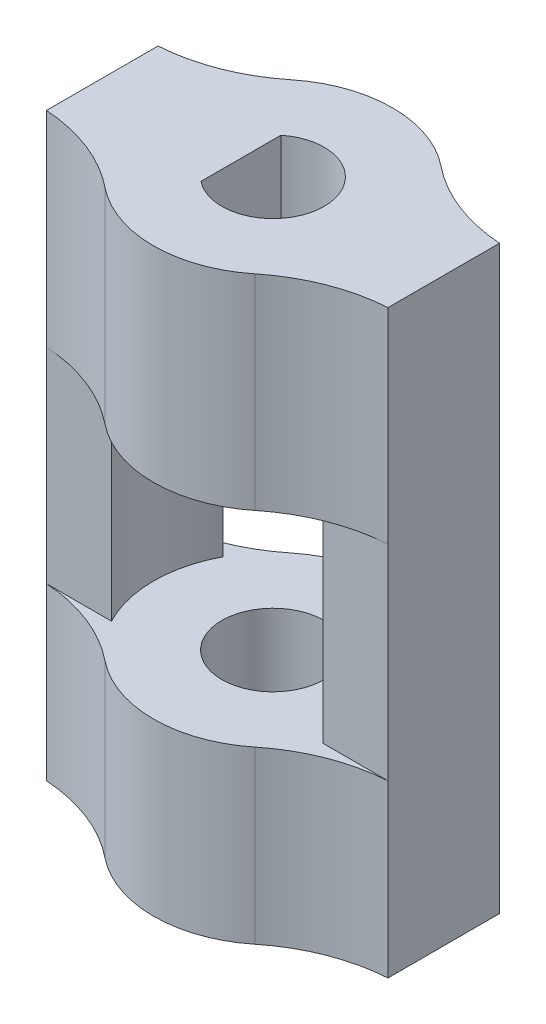
ISO-10303-21;
HEADER;
FILE_DESCRIPTION(('STEP AP214'),'2;1');
FILE_NAME('part.step','',(''),(''),'','','');
FILE_SCHEMA(('AUTOMOTIVE_DESIGN { 1 0 10303 214 1 1 1 1 }'));
ENDSEC;
DATA;
#1=APPLICATION_CONTEXT('core data for automotive mechanical design processes');
#2=APPLICATION_PROTOCOL_DEFINITION('international standard','automotive_design',2000,#1);
#3=PRODUCT_CONTEXT('',#1,'mechanical');
#4=PRODUCT('Part','Part','',(#3));
#5=PRODUCT_RELATED_PRODUCT_CATEGORY('part','',(#4));
#6=PRODUCT_DEFINITION_FORMATION('','',#4);
#7=PRODUCT_DEFINITION_CONTEXT('part definition',#1,'design');
#8=PRODUCT_DEFINITION('design','',#6,#7);
#9=PRODUCT_DEFINITION_SHAPE('','',#8);
#10=(LENGTH_UNIT() NAMED_UNIT(*) SI_UNIT(.MILLI.,.METRE.));
#11=(NAMED_UNIT(*) PLANE_ANGLE_UNIT() SI_UNIT($,.RADIAN.));
#12=(NAMED_UNIT(*) SI_UNIT($,.STERADIAN.) SOLID_ANGLE_UNIT());
#13=UNCERTAINTY_MEASURE_WITH_UNIT(LENGTH_MEASURE(1.E-05),#10,'distance_accuracy_value','');
#14=(GEOMETRIC_REPRESENTATION_CONTEXT(3) GLOBAL_UNCERTAINTY_ASSIGNED_CONTEXT((#13)) GLOBAL_UNIT_ASSIGNED_CONTEXT((#10,
#11,#12)) REPRESENTATION_CONTEXT('',''));
#15=CARTESIAN_POINT('',(0.,0.,0.));
#16=DIRECTION('',(0.,0.,1.));
#17=DIRECTION('',(1.,0.,0.));
#18=AXIS2_PLACEMENT_3D('',#15,#16,#17);
#19=CARTESIAN_POINT('',(0.,10.,0.));
#20=DIRECTION('',(0.,1.,0.));
#21=DIRECTION('',(0.,0.,1.));
#22=AXIS2_PLACEMENT_3D('',#19,#20,#21);
#23=PLANE('',#22);
#24=CARTESIAN_POINT('',(0.,10.,0.));
#25=DIRECTION('',(0.,1.,0.));
#26=DIRECTION('',(0.,0.,1.));
#27=AXIS2_PLACEMENT_3D('',#24,#25,#26);
#28=CIRCLE('',#27,7.);
#29=CARTESIAN_POINT('',(-6.19106594490267,10.,-3.26660411832632));
#30=VERTEX_POINT('',#29);
#31=CARTESIAN_POINT('',(-6.19106594490267,10.,3.26660411832632));
#32=VERTEX_POINT('',#31);
#33=EDGE_CURVE('E255',#30,#32,#28,.T.);
#34=ORIENTED_EDGE('',*,*,#33,.T.);
#35=DIRECTION('',(1.,0.,0.));
#36=VECTOR('',#35,1.);
#37=CARTESIAN_POINT('',(0.,10.,3.26660411832632));
#38=LINE('',#37,#36);
#39=CARTESIAN_POINT('',(-10.,10.,3.26660411832632));
#40=VERTEX_POINT('',#39);
#41=EDGE_CURVE('E343',#40,#32,#38,.T.);
#42=ORIENTED_EDGE('',*,*,#41,.F.);
#43=CARTESIAN_POINT('',(-10.6569167238109,10.,13.2450038105604));
#44=DIRECTION('',(0.,1.,0.));
#45=DIRECTION('',(0.,0.,1.));
#46=AXIS2_PLACEMENT_3D('',#43,#44,#45);
#47=CIRCLE('',#46,10.);
#48=CARTESIAN_POINT('',(-4.38814218039272,10.,5.45382509846605));
#49=VERTEX_POINT('',#48);
#50=EDGE_CURVE('E371',#40,#49,#47,.F.);
#51=ORIENTED_EDGE('',*,*,#50,.T.);
#52=CARTESIAN_POINT('',(0.,10.,0.));
#53=DIRECTION('',(0.,1.,0.));
#54=DIRECTION('',(0.,0.,1.));
#55=AXIS2_PLACEMENT_3D('',#52,#53,#54);
#56=CIRCLE('',#55,7.);
#57=CARTESIAN_POINT('',(4.38814218039272,10.,5.45382509846605));
#58=VERTEX_POINT('',#57);
#59=EDGE_CURVE('E282',#49,#58,#56,.T.);
#60=ORIENTED_EDGE('',*,*,#59,.T.);
#61=CARTESIAN_POINT('',(10.6569167238109,10.,13.2450038105604));
#62=DIRECTION('',(0.,1.,0.));
#63=DIRECTION('',(0.,0.,1.));
#64=AXIS2_PLACEMENT_3D('',#61,#62,#63);
#65=CIRCLE('',#64,10.);
#66=CARTESIAN_POINT('',(10.,10.,3.26660411832632));
#67=VERTEX_POINT('',#66);
#68=EDGE_CURVE('E363',#58,#67,#65,.F.);
#69=ORIENTED_EDGE('',*,*,#68,.T.);
#70=DIRECTION('',(1.,0.,0.));
#71=VECTOR('',#70,1.);
#72=CARTESIAN_POINT('',(0.,10.,3.26660411832632));
#73=LINE('',#72,#71);
#74=CARTESIAN_POINT('',(6.19106594490267,10.,3.26660411832632));
#75=VERTEX_POINT('',#74);
#76=EDGE_CURVE('E327',#75,#67,#73,.T.);
#77=ORIENTED_EDGE('',*,*,#76,.F.);
#78=CARTESIAN_POINT('',(0.,10.,0.));
#79=DIRECTION('',(0.,1.,0.));
#80=DIRECTION('',(0.,0.,1.));
#81=AXIS2_PLACEMENT_3D('',#78,#79,#80);
#82=CIRCLE('',#81,7.);
#83=CARTESIAN_POINT('',(6.19106594490267,10.,-3.26660411832632));
#84=VERTEX_POINT('',#83);
#85=EDGE_CURVE('E269',#75,#84,#82,.T.);
#86=ORIENTED_EDGE('',*,*,#85,.T.);
#87=DIRECTION('',(-1.,0.,0.));
#88=VECTOR('',#87,1.);
#89=CARTESIAN_POINT('',(0.,10.,-3.26660411832632));
#90=LINE('',#89,#88);
#91=CARTESIAN_POINT('',(10.,10.,-3.26660411832632));
#92=VERTEX_POINT('',#91);
#93=EDGE_CURVE('E359',#92,#84,#90,.T.);
#94=ORIENTED_EDGE('',*,*,#93,.F.);
#95=CARTESIAN_POINT('',(10.6569167238109,10.,-13.2450038105604));
#96=DIRECTION('',(0.,1.,0.));
#97=DIRECTION('',(0.,0.,1.));
#98=AXIS2_PLACEMENT_3D('',#95,#96,#97);
#99=CIRCLE('',#98,10.);
#100=CARTESIAN_POINT('',(4.38814218039272,10.,-5.45382509846605));
#101=VERTEX_POINT('',#100);
#102=EDGE_CURVE('E387',#92,#101,#99,.F.);
#103=ORIENTED_EDGE('',*,*,#102,.T.);
#104=CARTESIAN_POINT('',(0.,10.,0.));
#105=DIRECTION('',(0.,1.,0.));
#106=DIRECTION('',(0.,0.,1.));
#107=AXIS2_PLACEMENT_3D('',#104,#105,#106);
#108=CIRCLE('',#107,7.);
#109=CARTESIAN_POINT('',(-4.38814218039272,10.,-5.45382509846605));
#110=VERTEX_POINT('',#109);
#111=EDGE_CURVE('E285',#101,#110,#108,.T.);
#112=ORIENTED_EDGE('',*,*,#111,.T.);
#113=CARTESIAN_POINT('',(-10.6569167238109,10.,-13.2450038105604));
#114=DIRECTION('',(0.,1.,0.));
#115=DIRECTION('',(0.,0.,1.));
#116=AXIS2_PLACEMENT_3D('',#113,#114,#115);
#117=CIRCLE('',#116,10.);
#118=CARTESIAN_POINT('',(-10.,10.,-3.26660411832632));
#119=VERTEX_POINT('',#118);
#120=EDGE_CURVE('E383',#110,#119,#117,.F.);
#121=ORIENTED_EDGE('',*,*,#120,.T.);
#122=DIRECTION('',(-1.,0.,0.));
#123=VECTOR('',#122,1.);
#124=CARTESIAN_POINT('',(0.,10.,-3.26660411832632));
#125=LINE('',#124,#123);
#126=EDGE_CURVE('E90',#30,#119,#125,.T.);
#127=ORIENTED_EDGE('',*,*,#126,.F.);
#128=EDGE_LOOP('',(#34,#42,#51,#60,#69,#77,#86,#94,#103,#112,#121,#127));
#129=FACE_BOUND('',#128,.T.);
#130=CARTESIAN_POINT('',(0.,10.,0.));
#131=DIRECTION('',(0.,1.,0.));
#132=DIRECTION('',(0.,0.,1.));
#133=AXIS2_PLACEMENT_3D('',#130,#131,#132);
#134=CIRCLE('',#133,3.);
#135=CARTESIAN_POINT('',(0.,10.,3.));
#136=VERTEX_POINT('',#135);
#137=EDGE_CURVE('E289',#136,#136,#134,.T.);
#138=ORIENTED_EDGE('',*,*,#137,.F.);
#139=EDGE_LOOP('',(#138));
#140=FACE_BOUND('',#139,.T.);
#141=ADVANCED_FACE('F67',(#129,#140),#23,.T.);
#142=CARTESIAN_POINT('',(0.,10.,3.26660411832632));
#143=DIRECTION('',(0.,0.,-1.));
#144=DIRECTION('',(-1.,0.,0.));
#145=AXIS2_PLACEMENT_3D('',#142,#143,#144);
#146=PLANE('',#145);
#147=DIRECTION('',(0.,-1.,0.));
#148=VECTOR('',#147,1.);
#149=CARTESIAN_POINT('',(-10.,10.,3.26660411832632));
#150=LINE('',#149,#148);
#151=CARTESIAN_POINT('',(-10.,22.,3.26660411832632));
#152=VERTEX_POINT('',#151);
#153=EDGE_CURVE('E310',#152,#40,#150,.T.);
#154=ORIENTED_EDGE('',*,*,#153,.T.);
#155=ORIENTED_EDGE('',*,*,#41,.T.);
#156=DIRECTION('',(0.,-1.,0.));
#157=VECTOR('',#156,1.);
#158=CARTESIAN_POINT('',(-6.19106594490267,22.,3.26660411832632));
#159=LINE('',#158,#157);
#160=CARTESIAN_POINT('',(-6.19106594490267,22.,3.26660411832632));
#161=VERTEX_POINT('',#160);
#162=EDGE_CURVE('E266',#161,#32,#159,.T.);
#163=ORIENTED_EDGE('',*,*,#162,.F.);
#164=DIRECTION('',(-1.,0.,0.));
#165=VECTOR('',#164,1.);
#166=CARTESIAN_POINT('',(0.,22.,3.26660411832632));
#167=LINE('',#166,#165);
#168=EDGE_CURVE('E340',#161,#152,#167,.T.);
#169=ORIENTED_EDGE('',*,*,#168,.T.);
#170=EDGE_LOOP('',(#154,#155,#163,#169));
#171=FACE_BOUND('',#170,.T.);
#172=ADVANCED_FACE('F480',(#171),#146,.F.);
#173=CARTESIAN_POINT('',(0.,10.,0.));
#174=DIRECTION('',(0.,-1.,0.));
#175=DIRECTION('',(0.,0.,-1.));
#176=AXIS2_PLACEMENT_3D('',#173,#174,#175);
#177=CYLINDRICAL_SURFACE('',#176,7.);
#178=CARTESIAN_POINT('',(0.,0.,0.));
#179=DIRECTION('',(0.,1.,0.));
#180=DIRECTION('',(0.,0.,1.));
#181=AXIS2_PLACEMENT_3D('',#178,#179,#180);
#182=CIRCLE('',#181,7.);
#183=CARTESIAN_POINT('',(-4.38814218039272,0.,5.45382509846605));
#184=VERTEX_POINT('',#183);
#185=CARTESIAN_POINT('',(4.38814218039272,0.,5.45382509846605));
#186=VERTEX_POINT('',#185);
#187=EDGE_CURVE('E281',#184,#186,#182,.T.);
#188=ORIENTED_EDGE('',*,*,#187,.T.);
#189=DIRECTION('',(0.,-1.,0.));
#190=VECTOR('',#189,1.);
#191=CARTESIAN_POINT('',(4.38814218039272,10.,5.45382509846606));
#192=LINE('',#191,#190);
#193=EDGE_CURVE('E333',#186,#58,#192,.F.);
#194=ORIENTED_EDGE('',*,*,#193,.T.);
#195=ORIENTED_EDGE('',*,*,#59,.F.);
#196=DIRECTION('',(0.,-1.,0.));
#197=VECTOR('',#196,1.);
#198=CARTESIAN_POINT('',(-4.38814218039272,10.,5.45382509846606));
#199=LINE('',#198,#197);
#200=EDGE_CURVE('E330',#49,#184,#199,.T.);
#201=ORIENTED_EDGE('',*,*,#200,.T.);
#202=EDGE_LOOP('',(#188,#194,#195,#201));
#203=FACE_BOUND('',#202,.T.);
#204=ADVANCED_FACE('F450',(#203),#177,.T.);
#205=CARTESIAN_POINT('',(0.,10.,3.26660411832632));
#206=DIRECTION('',(0.,0.,-1.));
#207=DIRECTION('',(-1.,0.,0.));
#208=AXIS2_PLACEMENT_3D('',#205,#206,#207);
#209=PLANE('',#208);
#210=DIRECTION('',(0.,-1.,0.));
#211=VECTOR('',#210,1.);
#212=CARTESIAN_POINT('',(6.19106594490267,22.,3.26660411832632));
#213=LINE('',#212,#211);
#214=CARTESIAN_POINT('',(6.19106594490267,22.,3.26660411832632));
#215=VERTEX_POINT('',#214);
#216=EDGE_CURVE('E273',#215,#75,#213,.T.);
#217=ORIENTED_EDGE('',*,*,#216,.T.);
#218=ORIENTED_EDGE('',*,*,#76,.T.);
#219=DIRECTION('',(0.,-1.,0.));
#220=VECTOR('',#219,1.);
#221=CARTESIAN_POINT('',(10.,10.,3.26660411832632));
#222=LINE('',#221,#220);
#223=CARTESIAN_POINT('',(10.,22.,3.26660411832632));
#224=VERTEX_POINT('',#223);
#225=EDGE_CURVE('E325',#224,#67,#222,.T.);
#226=ORIENTED_EDGE('',*,*,#225,.F.);
#227=DIRECTION('',(-1.,0.,0.));
#228=VECTOR('',#227,1.);
#229=CARTESIAN_POINT('',(0.,22.,3.26660411832632));
#230=LINE('',#229,#228);
#231=EDGE_CURVE('E324',#224,#215,#230,.T.);
#232=ORIENTED_EDGE('',*,*,#231,.T.);
#233=EDGE_LOOP('',(#217,#218,#226,#232));
#234=FACE_BOUND('',#233,.T.);
#235=ADVANCED_FACE('F476',(#234),#209,.F.);
#236=CARTESIAN_POINT('',(10.,10.,0.));
#237=DIRECTION('',(-1.,0.,0.));
#238=DIRECTION('',(0.,0.,1.));
#239=AXIS2_PLACEMENT_3D('',#236,#237,#238);
#240=PLANE('',#239);
#241=DIRECTION('',(0.,0.,-1.));
#242=VECTOR('',#241,1.);
#243=CARTESIAN_POINT('',(10.,0.,0.));
#244=LINE('',#243,#242);
#245=CARTESIAN_POINT('',(10.,0.,3.26660411832632));
#246=VERTEX_POINT('',#245);
#247=CARTESIAN_POINT('',(10.,0.,-3.26660411832632));
#248=VERTEX_POINT('',#247);
#249=EDGE_CURVE('E295',#246,#248,#244,.T.);
#250=ORIENTED_EDGE('',*,*,#249,.T.);
#251=DIRECTION('',(0.,-1.,0.));
#252=VECTOR('',#251,1.);
#253=CARTESIAN_POINT('',(10.,10.,-3.26660411832632));
#254=LINE('',#253,#252);
#255=EDGE_CURVE('E314',#92,#248,#254,.T.);
#256=ORIENTED_EDGE('',*,*,#255,.F.);
#257=CARTESIAN_POINT('',(10.,22.,-3.26660411832632));
#258=VERTEX_POINT('',#257);
#259=EDGE_CURVE('E320',#258,#92,#254,.T.);
#260=ORIENTED_EDGE('',*,*,#259,.F.);
#261=CARTESIAN_POINT('',(10.,34.,-3.26660411832632));
#262=VERTEX_POINT('',#261);
#263=EDGE_CURVE('E316',#262,#258,#254,.T.);
#264=ORIENTED_EDGE('',*,*,#263,.F.);
#265=DIRECTION('',(0.,0.,1.));
#266=VECTOR('',#265,1.);
#267=CARTESIAN_POINT('',(10.,34.,0.));
#268=LINE('',#267,#266);
#269=CARTESIAN_POINT('',(10.,34.,3.26660411832632));
#270=VERTEX_POINT('',#269);
#271=EDGE_CURVE('E249',#262,#270,#268,.T.);
#272=ORIENTED_EDGE('',*,*,#271,.T.);
#273=EDGE_CURVE('E321',#270,#224,#222,.T.);
#274=ORIENTED_EDGE('',*,*,#273,.T.);
#275=ORIENTED_EDGE('',*,*,#225,.T.);
#276=EDGE_CURVE('E319',#67,#246,#222,.T.);
#277=ORIENTED_EDGE('',*,*,#276,.T.);
#278=EDGE_LOOP('',(#250,#256,#260,#264,#272,#274,#275,#277));
#279=FACE_BOUND('',#278,.T.);
#280=ADVANCED_FACE('F399',(#279),#240,.F.);
#281=CARTESIAN_POINT('',(0.,10.,-3.26660411832632));
#282=DIRECTION('',(0.,0.,-1.));
#283=DIRECTION('',(-1.,0.,0.));
#284=AXIS2_PLACEMENT_3D('',#281,#282,#283);
#285=PLANE('',#284);
#286=ORIENTED_EDGE('',*,*,#259,.T.);
#287=ORIENTED_EDGE('',*,*,#93,.T.);
#288=DIRECTION('',(0.,-1.,0.));
#289=VECTOR('',#288,1.);
#290=CARTESIAN_POINT('',(6.19106594490267,22.,-3.26660411832632));
#291=LINE('',#290,#289);
#292=CARTESIAN_POINT('',(6.19106594490267,22.,-3.26660411832632));
#293=VERTEX_POINT('',#292);
#294=EDGE_CURVE('E278',#293,#84,#291,.T.);
#295=ORIENTED_EDGE('',*,*,#294,.F.);
#296=DIRECTION('',(1.,0.,0.));
#297=VECTOR('',#296,1.);
#298=CARTESIAN_POINT('',(0.,22.,-3.26660411832632));
#299=LINE('',#298,#297);
#300=EDGE_CURVE('E82',#293,#258,#299,.T.);
#301=ORIENTED_EDGE('',*,*,#300,.T.);
#302=EDGE_LOOP('',(#286,#287,#295,#301));
#303=FACE_BOUND('',#302,.T.);
#304=ADVANCED_FACE('F395',(#303),#285,.T.);
#305=CARTESIAN_POINT('',(0.,10.,0.));
#306=DIRECTION('',(0.,-1.,0.));
#307=DIRECTION('',(0.,0.,-1.));
#308=AXIS2_PLACEMENT_3D('',#305,#306,#307);
#309=CYLINDRICAL_SURFACE('',#308,7.);
#310=CARTESIAN_POINT('',(0.,0.,0.));
#311=DIRECTION('',(0.,1.,0.));
#312=DIRECTION('',(0.,0.,1.));
#313=AXIS2_PLACEMENT_3D('',#310,#311,#312);
#314=CIRCLE('',#313,7.);
#315=CARTESIAN_POINT('',(4.38814218039272,0.,-5.45382509846605));
#316=VERTEX_POINT('',#315);
#317=CARTESIAN_POINT('',(-4.38814218039272,0.,-5.45382509846605));
#318=VERTEX_POINT('',#317);
#319=EDGE_CURVE('E298',#316,#318,#314,.T.);
#320=ORIENTED_EDGE('',*,*,#319,.T.);
#321=DIRECTION('',(0.,-1.,0.));
#322=VECTOR('',#321,1.);
#323=CARTESIAN_POINT('',(-4.38814218039272,10.,-5.45382509846606));
#324=LINE('',#323,#322);
#325=EDGE_CURVE('E356',#318,#110,#324,.F.);
#326=ORIENTED_EDGE('',*,*,#325,.T.);
#327=ORIENTED_EDGE('',*,*,#111,.F.);
#328=DIRECTION('',(0.,-1.,0.));
#329=VECTOR('',#328,1.);
#330=CARTESIAN_POINT('',(4.38814218039272,10.,-5.45382509846606));
#331=LINE('',#330,#329);
#332=EDGE_CURVE('E353',#101,#316,#331,.T.);
#333=ORIENTED_EDGE('',*,*,#332,.T.);
#334=EDGE_LOOP('',(#320,#326,#327,#333));
#335=FACE_BOUND('',#334,.T.);
#336=ADVANCED_FACE('F466',(#335),#309,.T.);
#337=CARTESIAN_POINT('',(0.,10.,-3.26660411832632));
#338=DIRECTION('',(0.,0.,-1.));
#339=DIRECTION('',(-1.,0.,0.));
#340=AXIS2_PLACEMENT_3D('',#337,#338,#339);
#341=PLANE('',#340);
#342=DIRECTION('',(0.,-1.,0.));
#343=VECTOR('',#342,1.);
#344=CARTESIAN_POINT('',(-10.,10.,-3.26660411832632));
#345=LINE('',#344,#343);
#346=CARTESIAN_POINT('',(-10.,22.,-3.26660411832632));
#347=VERTEX_POINT('',#346);
#348=EDGE_CURVE('E315',#347,#119,#345,.T.);
#349=ORIENTED_EDGE('',*,*,#348,.F.);
#350=DIRECTION('',(1.,0.,0.));
#351=VECTOR('',#350,1.);
#352=CARTESIAN_POINT('',(0.,22.,-3.26660411832632));
#353=LINE('',#352,#351);
#354=CARTESIAN_POINT('',(-6.19106594490266,22.,-3.26660411832632));
#355=VERTEX_POINT('',#354);
#356=EDGE_CURVE('E346',#347,#355,#353,.T.);
#357=ORIENTED_EDGE('',*,*,#356,.T.);
#358=DIRECTION('',(0.,-1.,0.));
#359=VECTOR('',#358,1.);
#360=CARTESIAN_POINT('',(-6.19106594490267,22.,-3.26660411832632));
#361=LINE('',#360,#359);
#362=EDGE_CURVE('E263',#355,#30,#361,.T.);
#363=ORIENTED_EDGE('',*,*,#362,.T.);
#364=ORIENTED_EDGE('',*,*,#126,.T.);
#365=EDGE_LOOP('',(#349,#357,#363,#364));
#366=FACE_BOUND('',#365,.T.);
#367=ADVANCED_FACE('F486',(#366),#341,.T.);
#368=CARTESIAN_POINT('',(-10.,10.,0.));
#369=DIRECTION('',(-1.,0.,0.));
#370=DIRECTION('',(0.,0.,1.));
#371=AXIS2_PLACEMENT_3D('',#368,#369,#370);
#372=PLANE('',#371);
#373=DIRECTION('',(0.,0.,-1.));
#374=VECTOR('',#373,1.);
#375=CARTESIAN_POINT('',(-10.,0.,0.));
#376=LINE('',#375,#374);
#377=CARTESIAN_POINT('',(-10.,0.,3.26660411832632));
#378=VERTEX_POINT('',#377);
#379=CARTESIAN_POINT('',(-10.,0.,-3.26660411832632));
#380=VERTEX_POINT('',#379);
#381=EDGE_CURVE('E301',#378,#380,#376,.T.);
#382=ORIENTED_EDGE('',*,*,#381,.F.);
#383=EDGE_CURVE('E292',#40,#378,#150,.T.);
#384=ORIENTED_EDGE('',*,*,#383,.F.);
#385=ORIENTED_EDGE('',*,*,#153,.F.);
#386=CARTESIAN_POINT('',(-10.,34.,3.26660411832632));
#387=VERTEX_POINT('',#386);
#388=EDGE_CURVE('E306',#387,#152,#150,.T.);
#389=ORIENTED_EDGE('',*,*,#388,.F.);
#390=DIRECTION('',(0.,0.,1.));
#391=VECTOR('',#390,1.);
#392=CARTESIAN_POINT('',(-10.,34.,0.));
#393=LINE('',#392,#391);
#394=CARTESIAN_POINT('',(-10.,34.,-3.26660411832632));
#395=VERTEX_POINT('',#394);
#396=EDGE_CURVE('E242',#395,#387,#393,.T.);
#397=ORIENTED_EDGE('',*,*,#396,.F.);
#398=EDGE_CURVE('E311',#395,#347,#345,.T.);
#399=ORIENTED_EDGE('',*,*,#398,.T.);
#400=ORIENTED_EDGE('',*,*,#348,.T.);
#401=EDGE_CURVE('E309',#119,#380,#345,.T.);
#402=ORIENTED_EDGE('',*,*,#401,.T.);
#403=EDGE_LOOP('',(#382,#384,#385,#389,#397,#399,#400,#402));
#404=FACE_BOUND('',#403,.T.);
#405=ADVANCED_FACE('F417',(#404),#372,.T.);
#406=CARTESIAN_POINT('',(0.,10.,0.));
#407=DIRECTION('',(0.,-1.,0.));
#408=DIRECTION('',(0.,0.,-1.));
#409=AXIS2_PLACEMENT_3D('',#406,#407,#408);
#410=CYLINDRICAL_SURFACE('',#409,3.);
#411=ORIENTED_EDGE('',*,*,#137,.T.);
#412=EDGE_LOOP('',(#411));
#413=FACE_BOUND('',#412,.T.);
#414=CARTESIAN_POINT('',(0.,0.,0.));
#415=DIRECTION('',(0.,1.,0.));
#416=DIRECTION('',(0.,0.,1.));
#417=AXIS2_PLACEMENT_3D('',#414,#415,#416);
#418=CIRCLE('',#417,3.);
#419=CARTESIAN_POINT('',(0.,0.,3.));
#420=VERTEX_POINT('',#419);
#421=EDGE_CURVE('E286',#420,#420,#418,.T.);
#422=ORIENTED_EDGE('',*,*,#421,.F.);
#423=EDGE_LOOP('',(#422));
#424=FACE_BOUND('',#423,.T.);
#425=ADVANCED_FACE('F493',(#413,#424),#410,.F.);
#426=CARTESIAN_POINT('',(0.,0.,0.));
#427=DIRECTION('',(0.,1.,0.));
#428=DIRECTION('',(0.,0.,1.));
#429=AXIS2_PLACEMENT_3D('',#426,#427,#428);
#430=PLANE('',#429);
#431=ORIENTED_EDGE('',*,*,#187,.F.);
#432=CARTESIAN_POINT('',(-10.6569167238109,0.,13.2450038105604));
#433=DIRECTION('',(0.,1.,0.));
#434=DIRECTION('',(0.,0.,1.));
#435=AXIS2_PLACEMENT_3D('',#432,#433,#434);
#436=CIRCLE('',#435,10.);
#437=EDGE_CURVE('E369',#184,#378,#436,.T.);
#438=ORIENTED_EDGE('',*,*,#437,.T.);
#439=ORIENTED_EDGE('',*,*,#381,.T.);
#440=CARTESIAN_POINT('',(-10.6569167238109,0.,-13.2450038105604));
#441=DIRECTION('',(0.,1.,0.));
#442=DIRECTION('',(0.,0.,1.));
#443=AXIS2_PLACEMENT_3D('',#440,#441,#442);
#444=CIRCLE('',#443,10.);
#445=EDGE_CURVE('E381',#380,#318,#444,.T.);
#446=ORIENTED_EDGE('',*,*,#445,.T.);
#447=ORIENTED_EDGE('',*,*,#319,.F.);
#448=CARTESIAN_POINT('',(10.6569167238109,0.,-13.2450038105604));
#449=DIRECTION('',(0.,1.,0.));
#450=DIRECTION('',(0.,0.,1.));
#451=AXIS2_PLACEMENT_3D('',#448,#449,#450);
#452=CIRCLE('',#451,10.);
#453=EDGE_CURVE('E385',#316,#248,#452,.T.);
#454=ORIENTED_EDGE('',*,*,#453,.T.);
#455=ORIENTED_EDGE('',*,*,#249,.F.);
#456=CARTESIAN_POINT('',(10.6569167238109,0.,13.2450038105604));
#457=DIRECTION('',(0.,1.,0.));
#458=DIRECTION('',(0.,0.,1.));
#459=AXIS2_PLACEMENT_3D('',#456,#457,#458);
#460=CIRCLE('',#459,10.);
#461=EDGE_CURVE('E361',#246,#186,#460,.T.);
#462=ORIENTED_EDGE('',*,*,#461,.T.);
#463=EDGE_LOOP('',(#431,#438,#439,#446,#447,#454,#455,#462));
#464=FACE_BOUND('',#463,.T.);
#465=ORIENTED_EDGE('',*,*,#421,.T.);
#466=EDGE_LOOP('',(#465));
#467=FACE_BOUND('',#466,.T.);
#468=ADVANCED_FACE('F447',(#464,#467),#430,.F.);
#469=CARTESIAN_POINT('',(0.,22.,0.));
#470=DIRECTION('',(0.,-1.,0.));
#471=DIRECTION('',(0.,0.,-1.));
#472=AXIS2_PLACEMENT_3D('',#469,#470,#471);
#473=CYLINDRICAL_SURFACE('',#472,7.);
#474=ORIENTED_EDGE('',*,*,#85,.F.);
#475=ORIENTED_EDGE('',*,*,#216,.F.);
#476=CARTESIAN_POINT('',(0.,22.,0.));
#477=DIRECTION('',(0.,1.,0.));
#478=DIRECTION('',(0.,0.,1.));
#479=AXIS2_PLACEMENT_3D('',#476,#477,#478);
#480=CIRCLE('',#479,7.);
#481=EDGE_CURVE('E270',#215,#293,#480,.T.);
#482=ORIENTED_EDGE('',*,*,#481,.T.);
#483=ORIENTED_EDGE('',*,*,#294,.T.);
#484=EDGE_LOOP('',(#474,#475,#482,#483));
#485=FACE_BOUND('',#484,.T.);
#486=ADVANCED_FACE('F474',(#485),#473,.F.);
#487=CARTESIAN_POINT('',(0.,22.,0.));
#488=DIRECTION('',(0.,-1.,0.));
#489=DIRECTION('',(0.,0.,-1.));
#490=AXIS2_PLACEMENT_3D('',#487,#488,#489);
#491=CYLINDRICAL_SURFACE('',#490,7.);
#492=ORIENTED_EDGE('',*,*,#33,.F.);
#493=ORIENTED_EDGE('',*,*,#362,.F.);
#494=CARTESIAN_POINT('',(0.,22.,0.));
#495=DIRECTION('',(0.,1.,0.));
#496=DIRECTION('',(0.,0.,1.));
#497=AXIS2_PLACEMENT_3D('',#494,#495,#496);
#498=CIRCLE('',#497,7.);
#499=EDGE_CURVE('E260',#355,#161,#498,.T.);
#500=ORIENTED_EDGE('',*,*,#499,.T.);
#501=ORIENTED_EDGE('',*,*,#162,.T.);
#502=EDGE_LOOP('',(#492,#493,#500,#501));
#503=FACE_BOUND('',#502,.T.);
#504=ADVANCED_FACE('F482',(#503),#491,.F.);
#505=CARTESIAN_POINT('',(0.,22.,0.));
#506=DIRECTION('',(0.,1.,0.));
#507=DIRECTION('',(0.,0.,1.));
#508=AXIS2_PLACEMENT_3D('',#505,#506,#507);
#509=PLANE('',#508);
#510=CARTESIAN_POINT('',(0.,22.,0.));
#511=DIRECTION('',(0.,1.,0.));
#512=DIRECTION('',(0.,0.,1.));
#513=AXIS2_PLACEMENT_3D('',#510,#511,#512);
#514=CIRCLE('',#513,3.);
#515=CARTESIAN_POINT('',(-1.87760648522506,22.,2.33978500863665));
#516=VERTEX_POINT('',#515);
#517=CARTESIAN_POINT('',(-1.87760648522506,22.,-2.33978500863665));
#518=VERTEX_POINT('',#517);
#519=EDGE_CURVE('E224',#516,#518,#514,.T.);
#520=ORIENTED_EDGE('',*,*,#519,.T.);
#521=DIRECTION('',(0.,0.,-1.));
#522=VECTOR('',#521,1.);
#523=CARTESIAN_POINT('',(-1.87760648522506,22.,0.));
#524=LINE('',#523,#522);
#525=EDGE_CURVE('E235',#516,#518,#524,.T.);
#526=ORIENTED_EDGE('',*,*,#525,.F.);
#527=EDGE_LOOP('',(#520,#526));
#528=FACE_BOUND('',#527,.T.);
#529=ORIENTED_EDGE('',*,*,#481,.F.);
#530=ORIENTED_EDGE('',*,*,#231,.F.);
#531=CARTESIAN_POINT('',(10.6569167238109,22.,13.2450038105604));
#532=DIRECTION('',(0.,1.,0.));
#533=DIRECTION('',(0.,0.,1.));
#534=AXIS2_PLACEMENT_3D('',#531,#532,#533);
#535=CIRCLE('',#534,10.);
#536=CARTESIAN_POINT('',(4.38814218039272,22.,5.45382509846605));
#537=VERTEX_POINT('',#536);
#538=EDGE_CURVE('E365',#224,#537,#535,.T.);
#539=ORIENTED_EDGE('',*,*,#538,.T.);
#540=CARTESIAN_POINT('',(0.,22.,0.));
#541=DIRECTION('',(0.,1.,0.));
#542=DIRECTION('',(0.,0.,1.));
#543=AXIS2_PLACEMENT_3D('',#540,#541,#542);
#544=CIRCLE('',#543,7.);
#545=CARTESIAN_POINT('',(-4.38814218039272,22.,5.45382509846605));
#546=VERTEX_POINT('',#545);
#547=EDGE_CURVE('E241',#546,#537,#544,.T.);
#548=ORIENTED_EDGE('',*,*,#547,.F.);
#549=CARTESIAN_POINT('',(-10.6569167238109,22.,13.2450038105604));
#550=DIRECTION('',(0.,1.,0.));
#551=DIRECTION('',(0.,0.,1.));
#552=AXIS2_PLACEMENT_3D('',#549,#550,#551);
#553=CIRCLE('',#552,10.);
#554=EDGE_CURVE('E373',#546,#152,#553,.T.);
#555=ORIENTED_EDGE('',*,*,#554,.T.);
#556=ORIENTED_EDGE('',*,*,#168,.F.);
#557=ORIENTED_EDGE('',*,*,#499,.F.);
#558=ORIENTED_EDGE('',*,*,#356,.F.);
#559=CARTESIAN_POINT('',(-10.6569167238109,22.,-13.2450038105604));
#560=DIRECTION('',(0.,1.,0.));
#561=DIRECTION('',(0.,0.,1.));
#562=AXIS2_PLACEMENT_3D('',#559,#560,#561);
#563=CIRCLE('',#562,10.);
#564=CARTESIAN_POINT('',(-4.38814218039272,22.,-5.45382509846605));
#565=VERTEX_POINT('',#564);
#566=EDGE_CURVE('E377',#347,#565,#563,.T.);
#567=ORIENTED_EDGE('',*,*,#566,.T.);
#568=CARTESIAN_POINT('',(0.,22.,0.));
#569=DIRECTION('',(0.,1.,0.));
#570=DIRECTION('',(0.,0.,1.));
#571=AXIS2_PLACEMENT_3D('',#568,#569,#570);
#572=CIRCLE('',#571,7.);
#573=CARTESIAN_POINT('',(4.38814218039272,22.,-5.45382509846605));
#574=VERTEX_POINT('',#573);
#575=EDGE_CURVE('E246',#574,#565,#572,.T.);
#576=ORIENTED_EDGE('',*,*,#575,.F.);
#577=CARTESIAN_POINT('',(10.6569167238109,22.,-13.2450038105604));
#578=DIRECTION('',(0.,1.,0.));
#579=DIRECTION('',(0.,0.,1.));
#580=AXIS2_PLACEMENT_3D('',#577,#578,#579);
#581=CIRCLE('',#580,10.);
#582=EDGE_CURVE('E75',#574,#258,#581,.T.);
#583=ORIENTED_EDGE('',*,*,#582,.T.);
#584=ORIENTED_EDGE('',*,*,#300,.F.);
#585=EDGE_LOOP('',(#529,#530,#539,#548,#555,#556,#557,#558,#567,#576,#583,#584));
#586=FACE_BOUND('',#585,.T.);
#587=ADVANCED_FACE('F389',(#528,#586),#509,.F.);
#588=CARTESIAN_POINT('',(0.,34.,0.));
#589=DIRECTION('',(0.,1.,0.));
#590=DIRECTION('',(0.,0.,1.));
#591=AXIS2_PLACEMENT_3D('',#588,#589,#590);
#592=PLANE('',#591);
#593=ORIENTED_EDGE('',*,*,#396,.T.);
#594=CARTESIAN_POINT('',(-10.6569167238109,34.,13.2450038105604));
#595=DIRECTION('',(0.,1.,0.));
#596=DIRECTION('',(0.,0.,1.));
#597=AXIS2_PLACEMENT_3D('',#594,#595,#596);
#598=CIRCLE('',#597,10.);
#599=CARTESIAN_POINT('',(-4.38814218039272,34.,5.45382509846605));
#600=VERTEX_POINT('',#599);
#601=EDGE_CURVE('E375',#387,#600,#598,.F.);
#602=ORIENTED_EDGE('',*,*,#601,.T.);
#603=CARTESIAN_POINT('',(0.,34.,0.));
#604=DIRECTION('',(0.,1.,0.));
#605=DIRECTION('',(0.,0.,1.));
#606=AXIS2_PLACEMENT_3D('',#603,#604,#605);
#607=CIRCLE('',#606,7.);
#608=CARTESIAN_POINT('',(4.38814218039272,34.,5.45382509846605));
#609=VERTEX_POINT('',#608);
#610=EDGE_CURVE('E245',#600,#609,#607,.T.);
#611=ORIENTED_EDGE('',*,*,#610,.T.);
#612=CARTESIAN_POINT('',(10.6569167238109,34.,13.2450038105604));
#613=DIRECTION('',(0.,1.,0.));
#614=DIRECTION('',(0.,0.,1.));
#615=AXIS2_PLACEMENT_3D('',#612,#613,#614);
#616=CIRCLE('',#615,10.);
#617=EDGE_CURVE('E367',#609,#270,#616,.F.);
#618=ORIENTED_EDGE('',*,*,#617,.T.);
#619=ORIENTED_EDGE('',*,*,#271,.F.);
#620=CARTESIAN_POINT('',(10.6569167238109,34.,-13.2450038105604));
#621=DIRECTION('',(0.,1.,0.));
#622=DIRECTION('',(0.,0.,1.));
#623=AXIS2_PLACEMENT_3D('',#620,#621,#622);
#624=CIRCLE('',#623,10.);
#625=CARTESIAN_POINT('',(4.38814218039272,34.,-5.45382509846605));
#626=VERTEX_POINT('',#625);
#627=EDGE_CURVE('E12',#262,#626,#624,.F.);
#628=ORIENTED_EDGE('',*,*,#627,.T.);
#629=CARTESIAN_POINT('',(0.,34.,0.));
#630=DIRECTION('',(0.,1.,0.));
#631=DIRECTION('',(0.,0.,1.));
#632=AXIS2_PLACEMENT_3D('',#629,#630,#631);
#633=CIRCLE('',#632,7.);
#634=CARTESIAN_POINT('',(-4.38814218039272,34.,-5.45382509846605));
#635=VERTEX_POINT('',#634);
#636=EDGE_CURVE('E252',#626,#635,#633,.T.);
#637=ORIENTED_EDGE('',*,*,#636,.T.);
#638=CARTESIAN_POINT('',(-10.6569167238109,34.,-13.2450038105604));
#639=DIRECTION('',(0.,1.,0.));
#640=DIRECTION('',(0.,0.,1.));
#641=AXIS2_PLACEMENT_3D('',#638,#639,#640);
#642=CIRCLE('',#641,10.);
#643=EDGE_CURVE('E379',#635,#395,#642,.F.);
#644=ORIENTED_EDGE('',*,*,#643,.T.);
#645=EDGE_LOOP('',(#593,#602,#611,#618,#619,#628,#637,#644));
#646=FACE_BOUND('',#645,.T.);
#647=DIRECTION('',(0.,0.,-1.));
#648=VECTOR('',#647,1.);
#649=CARTESIAN_POINT('',(-1.87760648522506,34.,0.));
#650=LINE('',#649,#648);
#651=CARTESIAN_POINT('',(-1.87760648522506,34.,2.33978500863665));
#652=VERTEX_POINT('',#651);
#653=CARTESIAN_POINT('',(-1.87760648522506,34.,-2.33978500863665));
#654=VERTEX_POINT('',#653);
#655=EDGE_CURVE('E229',#652,#654,#650,.T.);
#656=ORIENTED_EDGE('',*,*,#655,.T.);
#657=CARTESIAN_POINT('',(0.,34.,0.));
#658=DIRECTION('',(0.,1.,0.));
#659=DIRECTION('',(0.,0.,1.));
#660=AXIS2_PLACEMENT_3D('',#657,#658,#659);
#661=CIRCLE('',#660,3.);
#662=EDGE_CURVE('E221',#652,#654,#661,.T.);
#663=ORIENTED_EDGE('',*,*,#662,.F.);
#664=EDGE_LOOP('',(#656,#663));
#665=FACE_BOUND('',#664,.T.);
#666=ADVANCED_FACE('F234',(#646,#665),#592,.T.);
#667=CARTESIAN_POINT('',(0.,34.,0.));
#668=DIRECTION('',(0.,-1.,0.));
#669=DIRECTION('',(0.,0.,-1.));
#670=AXIS2_PLACEMENT_3D('',#667,#668,#669);
#671=CYLINDRICAL_SURFACE('',#670,7.);
#672=ORIENTED_EDGE('',*,*,#547,.T.);
#673=DIRECTION('',(0.,-1.,0.));
#674=VECTOR('',#673,1.);
#675=CARTESIAN_POINT('',(4.38814218039272,34.,5.45382509846606));
#676=LINE('',#675,#674);
#677=EDGE_CURVE('E338',#537,#609,#676,.F.);
#678=ORIENTED_EDGE('',*,*,#677,.T.);
#679=ORIENTED_EDGE('',*,*,#610,.F.);
#680=DIRECTION('',(0.,-1.,0.));
#681=VECTOR('',#680,1.);
#682=CARTESIAN_POINT('',(-4.38814218039272,34.,5.45382509846606));
#683=LINE('',#682,#681);
#684=EDGE_CURVE('E335',#600,#546,#683,.T.);
#685=ORIENTED_EDGE('',*,*,#684,.T.);
#686=EDGE_LOOP('',(#672,#678,#679,#685));
#687=FACE_BOUND('',#686,.T.);
#688=ADVANCED_FACE('F428',(#687),#671,.T.);
#689=CARTESIAN_POINT('',(0.,34.,0.));
#690=DIRECTION('',(0.,-1.,0.));
#691=DIRECTION('',(0.,0.,-1.));
#692=AXIS2_PLACEMENT_3D('',#689,#690,#691);
#693=CYLINDRICAL_SURFACE('',#692,7.);
#694=ORIENTED_EDGE('',*,*,#575,.T.);
#695=DIRECTION('',(0.,-1.,0.));
#696=VECTOR('',#695,1.);
#697=CARTESIAN_POINT('',(-4.38814218039272,34.,-5.45382509846606));
#698=LINE('',#697,#696);
#699=EDGE_CURVE('E351',#565,#635,#698,.F.);
#700=ORIENTED_EDGE('',*,*,#699,.T.);
#701=ORIENTED_EDGE('',*,*,#636,.F.);
#702=DIRECTION('',(0.,-1.,0.));
#703=VECTOR('',#702,1.);
#704=CARTESIAN_POINT('',(4.38814218039272,34.,-5.45382509846606));
#705=LINE('',#704,#703);
#706=EDGE_CURVE('E348',#626,#574,#705,.T.);
#707=ORIENTED_EDGE('',*,*,#706,.T.);
#708=EDGE_LOOP('',(#694,#700,#701,#707));
#709=FACE_BOUND('',#708,.T.);
#710=ADVANCED_FACE('F407',(#709),#693,.T.);
#711=CARTESIAN_POINT('',(0.,34.,0.));
#712=DIRECTION('',(0.,-1.,0.));
#713=DIRECTION('',(0.,0.,-1.));
#714=AXIS2_PLACEMENT_3D('',#711,#712,#713);
#715=CYLINDRICAL_SURFACE('',#714,3.);
#716=ORIENTED_EDGE('',*,*,#519,.F.);
#717=DIRECTION('',(0.,-1.,0.));
#718=VECTOR('',#717,1.);
#719=CARTESIAN_POINT('',(-1.87760648522506,34.,2.33978500863665));
#720=LINE('',#719,#718);
#721=EDGE_CURVE('E217',#652,#516,#720,.T.);
#722=ORIENTED_EDGE('',*,*,#721,.F.);
#723=ORIENTED_EDGE('',*,*,#662,.T.);
#724=DIRECTION('',(0.,-1.,0.));
#725=VECTOR('',#724,1.);
#726=CARTESIAN_POINT('',(-1.87760648522506,34.,-2.33978500863665));
#727=LINE('',#726,#725);
#728=EDGE_CURVE('E228',#654,#518,#727,.T.);
#729=ORIENTED_EDGE('',*,*,#728,.T.);
#730=EDGE_LOOP('',(#716,#722,#723,#729));
#731=FACE_BOUND('',#730,.T.);
#732=ADVANCED_FACE('F219',(#731),#715,.F.);
#733=CARTESIAN_POINT('',(-1.87760648522506,34.,0.));
#734=DIRECTION('',(-1.,0.,0.));
#735=DIRECTION('',(0.,0.,1.));
#736=AXIS2_PLACEMENT_3D('',#733,#734,#735);
#737=PLANE('',#736);
#738=ORIENTED_EDGE('',*,*,#525,.T.);
#739=ORIENTED_EDGE('',*,*,#728,.F.);
#740=ORIENTED_EDGE('',*,*,#655,.F.);
#741=ORIENTED_EDGE('',*,*,#721,.T.);
#742=EDGE_LOOP('',(#738,#739,#740,#741));
#743=FACE_BOUND('',#742,.T.);
#744=ADVANCED_FACE('F231',(#743),#737,.F.);
#745=CARTESIAN_POINT('',(10.6569167238109,10.,13.2450038105604));
#746=DIRECTION('',(0.,1.,0.));
#747=DIRECTION('',(0.,0.,1.));
#748=AXIS2_PLACEMENT_3D('',#745,#746,#747);
#749=CYLINDRICAL_SURFACE('',#748,10.);
#750=ORIENTED_EDGE('',*,*,#68,.F.);
#751=ORIENTED_EDGE('',*,*,#193,.F.);
#752=ORIENTED_EDGE('',*,*,#461,.F.);
#753=ORIENTED_EDGE('',*,*,#276,.F.);
#754=EDGE_LOOP('',(#750,#751,#752,#753));
#755=FACE_BOUND('',#754,.T.);
#756=ADVANCED_FACE('F443',(#755),#749,.F.);
#757=CARTESIAN_POINT('',(10.6569167238109,34.,13.2450038105604));
#758=DIRECTION('',(0.,1.,0.));
#759=DIRECTION('',(0.,0.,1.));
#760=AXIS2_PLACEMENT_3D('',#757,#758,#759);
#761=CYLINDRICAL_SURFACE('',#760,10.);
#762=ORIENTED_EDGE('',*,*,#617,.F.);
#763=ORIENTED_EDGE('',*,*,#677,.F.);
#764=ORIENTED_EDGE('',*,*,#538,.F.);
#765=ORIENTED_EDGE('',*,*,#273,.F.);
#766=EDGE_LOOP('',(#762,#763,#764,#765));
#767=FACE_BOUND('',#766,.T.);
#768=ADVANCED_FACE('F432',(#767),#761,.F.);
#769=CARTESIAN_POINT('',(-10.6569167238109,10.,13.2450038105604));
#770=DIRECTION('',(0.,1.,0.));
#771=DIRECTION('',(0.,0.,1.));
#772=AXIS2_PLACEMENT_3D('',#769,#770,#771);
#773=CYLINDRICAL_SURFACE('',#772,10.);
#774=ORIENTED_EDGE('',*,*,#50,.F.);
#775=ORIENTED_EDGE('',*,*,#383,.T.);
#776=ORIENTED_EDGE('',*,*,#437,.F.);
#777=ORIENTED_EDGE('',*,*,#200,.F.);
#778=EDGE_LOOP('',(#774,#775,#776,#777));
#779=FACE_BOUND('',#778,.T.);
#780=ADVANCED_FACE('F455',(#779),#773,.F.);
#781=CARTESIAN_POINT('',(-10.6569167238109,10.,13.2450038105604));
#782=DIRECTION('',(0.,1.,0.));
#783=DIRECTION('',(0.,0.,1.));
#784=AXIS2_PLACEMENT_3D('',#781,#782,#783);
#785=CYLINDRICAL_SURFACE('',#784,10.);
#786=ORIENTED_EDGE('',*,*,#601,.F.);
#787=ORIENTED_EDGE('',*,*,#388,.T.);
#788=ORIENTED_EDGE('',*,*,#554,.F.);
#789=ORIENTED_EDGE('',*,*,#684,.F.);
#790=EDGE_LOOP('',(#786,#787,#788,#789));
#791=FACE_BOUND('',#790,.T.);
#792=ADVANCED_FACE('F423',(#791),#785,.F.);
#793=CARTESIAN_POINT('',(-10.6569167238109,34.,-13.2450038105604));
#794=DIRECTION('',(0.,1.,0.));
#795=DIRECTION('',(0.,0.,1.));
#796=AXIS2_PLACEMENT_3D('',#793,#794,#795);
#797=CYLINDRICAL_SURFACE('',#796,10.);
#798=ORIENTED_EDGE('',*,*,#643,.F.);
#799=ORIENTED_EDGE('',*,*,#699,.F.);
#800=ORIENTED_EDGE('',*,*,#566,.F.);
#801=ORIENTED_EDGE('',*,*,#398,.F.);
#802=EDGE_LOOP('',(#798,#799,#800,#801));
#803=FACE_BOUND('',#802,.T.);
#804=ADVANCED_FACE('F410',(#803),#797,.F.);
#805=CARTESIAN_POINT('',(-10.6569167238109,10.,-13.2450038105604));
#806=DIRECTION('',(0.,1.,0.));
#807=DIRECTION('',(0.,0.,1.));
#808=AXIS2_PLACEMENT_3D('',#805,#806,#807);
#809=CYLINDRICAL_SURFACE('',#808,10.);
#810=ORIENTED_EDGE('',*,*,#120,.F.);
#811=ORIENTED_EDGE('',*,*,#325,.F.);
#812=ORIENTED_EDGE('',*,*,#445,.F.);
#813=ORIENTED_EDGE('',*,*,#401,.F.);
#814=EDGE_LOOP('',(#810,#811,#812,#813));
#815=FACE_BOUND('',#814,.T.);
#816=ADVANCED_FACE('F462',(#815),#809,.F.);
#817=CARTESIAN_POINT('',(10.6569167238109,10.,-13.2450038105604));
#818=DIRECTION('',(0.,1.,0.));
#819=DIRECTION('',(0.,0.,1.));
#820=AXIS2_PLACEMENT_3D('',#817,#818,#819);
#821=CYLINDRICAL_SURFACE('',#820,10.);
#822=ORIENTED_EDGE('',*,*,#102,.F.);
#823=ORIENTED_EDGE('',*,*,#255,.T.);
#824=ORIENTED_EDGE('',*,*,#453,.F.);
#825=ORIENTED_EDGE('',*,*,#332,.F.);
#826=EDGE_LOOP('',(#822,#823,#824,#825));
#827=FACE_BOUND('',#826,.T.);
#828=ADVANCED_FACE('F470',(#827),#821,.F.);
#829=CARTESIAN_POINT('',(10.6569167238109,10.,-13.2450038105604));
#830=DIRECTION('',(0.,1.,0.));
#831=DIRECTION('',(0.,0.,1.));
#832=AXIS2_PLACEMENT_3D('',#829,#830,#831);
#833=CYLINDRICAL_SURFACE('',#832,10.);
#834=ORIENTED_EDGE('',*,*,#627,.F.);
#835=ORIENTED_EDGE('',*,*,#263,.T.);
#836=ORIENTED_EDGE('',*,*,#582,.F.);
#837=ORIENTED_EDGE('',*,*,#706,.F.);
#838=EDGE_LOOP('',(#834,#835,#836,#837));
#839=FACE_BOUND('',#838,.T.);
#840=ADVANCED_FACE('F69',(#839),#833,.F.);
#841=CLOSED_SHELL('',(#141,#172,#204,#235,#280,#304,#336,#367,#405,#425,#468,#486,#504,#587,
#666,#688,#710,#732,#744,#756,#768,#780,#792,#804,#816,#828,#840));
#842=MANIFOLD_SOLID_BREP('B2',#841);
#843=ADVANCED_BREP_SHAPE_REPRESENTATION('',(#18,#842),#14);
#844=SHAPE_DEFINITION_REPRESENTATION(#9,#843);
ENDSEC;
END-ISO-10303-21;
